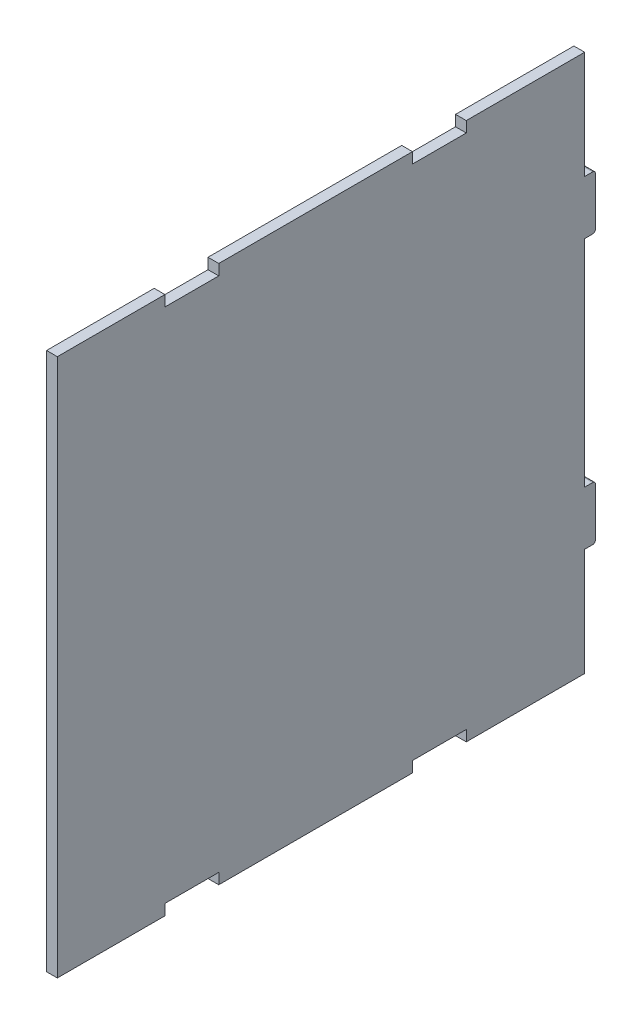
ISO-10303-21;
HEADER;
FILE_DESCRIPTION(('STEP AP214'),'2;1');
FILE_NAME('part.step','',(''),(''),'','','');
FILE_SCHEMA(('AUTOMOTIVE_DESIGN { 1 0 10303 214 1 1 1 1 }'));
ENDSEC;
DATA;
#1=APPLICATION_CONTEXT('core data for automotive mechanical design processes');
#2=APPLICATION_PROTOCOL_DEFINITION('international standard','automotive_design',2000,#1);
#3=PRODUCT_CONTEXT('',#1,'mechanical');
#4=PRODUCT('Part','Part','',(#3));
#5=PRODUCT_RELATED_PRODUCT_CATEGORY('part','',(#4));
#6=PRODUCT_DEFINITION_FORMATION('','',#4);
#7=PRODUCT_DEFINITION_CONTEXT('part definition',#1,'design');
#8=PRODUCT_DEFINITION('design','',#6,#7);
#9=PRODUCT_DEFINITION_SHAPE('','',#8);
#10=(LENGTH_UNIT() NAMED_UNIT(*) SI_UNIT(.MILLI.,.METRE.));
#11=(NAMED_UNIT(*) PLANE_ANGLE_UNIT() SI_UNIT($,.RADIAN.));
#12=(NAMED_UNIT(*) SI_UNIT($,.STERADIAN.) SOLID_ANGLE_UNIT());
#13=UNCERTAINTY_MEASURE_WITH_UNIT(LENGTH_MEASURE(1.E-05),#10,'distance_accuracy_value','');
#14=(GEOMETRIC_REPRESENTATION_CONTEXT(3) GLOBAL_UNCERTAINTY_ASSIGNED_CONTEXT((#13)) GLOBAL_UNIT_ASSIGNED_CONTEXT((#10,
#11,#12)) REPRESENTATION_CONTEXT('',''));
#15=CARTESIAN_POINT('',(0.,0.,0.));
#16=DIRECTION('',(0.,0.,1.));
#17=DIRECTION('',(1.,0.,0.));
#18=AXIS2_PLACEMENT_3D('',#15,#16,#17);
#19=CARTESIAN_POINT('',(-48.,50.,198.0199980004));
#20=DIRECTION('',(-1.,0.,0.));
#21=DIRECTION('',(0.,-1.,0.));
#22=AXIS2_PLACEMENT_3D('',#19,#20,#21);
#23=PLANE('',#22);
#24=DIRECTION('',(0.,0.,1.));
#25=VECTOR('',#24,1.);
#26=CARTESIAN_POINT('',(-48.,-30.,-12.1980390271856));
#27=LINE('',#26,#25);
#28=CARTESIAN_POINT('',(-48.,-30.,-1.5));
#29=VERTEX_POINT('',#28);
#30=CARTESIAN_POINT('',(-48.,-30.,0.));
#31=VERTEX_POINT('',#30);
#32=EDGE_CURVE('E346',#29,#31,#27,.T.);
#33=ORIENTED_EDGE('',*,*,#32,.F.);
#34=CARTESIAN_POINT('',(-48.,-29.5,-1.5));
#35=DIRECTION('',(-1.,0.,0.));
#36=DIRECTION('',(0.,-1.,0.));
#37=AXIS2_PLACEMENT_3D('',#34,#35,#36);
#38=CIRCLE('',#37,0.5);
#39=CARTESIAN_POINT('',(-48.,-29.5,-2.));
#40=VERTEX_POINT('',#39);
#41=EDGE_CURVE('E437',#29,#40,#38,.F.);
#42=ORIENTED_EDGE('',*,*,#41,.T.);
#43=DIRECTION('',(0.,-1.,0.));
#44=VECTOR('',#43,1.);
#45=CARTESIAN_POINT('',(-48.,-30.,-2.));
#46=LINE('',#45,#44);
#47=CARTESIAN_POINT('',(-48.,-20.5,-2.));
#48=VERTEX_POINT('',#47);
#49=EDGE_CURVE('E330',#48,#40,#46,.T.);
#50=ORIENTED_EDGE('',*,*,#49,.F.);
#51=CARTESIAN_POINT('',(-48.,-20.5,-1.5));
#52=DIRECTION('',(-1.,0.,0.));
#53=DIRECTION('',(0.,-1.,0.));
#54=AXIS2_PLACEMENT_3D('',#51,#52,#53);
#55=CIRCLE('',#54,0.5);
#56=CARTESIAN_POINT('',(-48.,-20.,-1.5));
#57=VERTEX_POINT('',#56);
#58=EDGE_CURVE('E435',#48,#57,#55,.F.);
#59=ORIENTED_EDGE('',*,*,#58,.T.);
#60=DIRECTION('',(0.,0.,1.));
#61=VECTOR('',#60,1.);
#62=CARTESIAN_POINT('',(-48.,-20.,-12.1980390271856));
#63=LINE('',#62,#61);
#64=CARTESIAN_POINT('',(-48.,-20.,0.));
#65=VERTEX_POINT('',#64);
#66=EDGE_CURVE('E348',#57,#65,#63,.T.);
#67=ORIENTED_EDGE('',*,*,#66,.T.);
#68=DIRECTION('',(0.,1.,0.));
#69=VECTOR('',#68,1.);
#70=CARTESIAN_POINT('',(-48.,50.,0.));
#71=LINE('',#70,#69);
#72=CARTESIAN_POINT('',(-48.,20.,0.));
#73=VERTEX_POINT('',#72);
#74=EDGE_CURVE('E392',#65,#73,#71,.T.);
#75=ORIENTED_EDGE('',*,*,#74,.T.);
#76=DIRECTION('',(0.,0.,1.));
#77=VECTOR('',#76,1.);
#78=CARTESIAN_POINT('',(-48.,20.,-12.1980390271856));
#79=LINE('',#78,#77);
#80=CARTESIAN_POINT('',(-48.,20.,-1.5));
#81=VERTEX_POINT('',#80);
#82=EDGE_CURVE('E365',#81,#73,#79,.T.);
#83=ORIENTED_EDGE('',*,*,#82,.F.);
#84=CARTESIAN_POINT('',(-48.,20.5,-1.5));
#85=DIRECTION('',(-1.,0.,0.));
#86=DIRECTION('',(0.,-1.,0.));
#87=AXIS2_PLACEMENT_3D('',#84,#85,#86);
#88=CIRCLE('',#87,0.5);
#89=CARTESIAN_POINT('',(-48.,20.5,-2.));
#90=VERTEX_POINT('',#89);
#91=EDGE_CURVE('E432',#81,#90,#88,.F.);
#92=ORIENTED_EDGE('',*,*,#91,.T.);
#93=DIRECTION('',(0.,1.,0.));
#94=VECTOR('',#93,1.);
#95=CARTESIAN_POINT('',(-48.,30.,-2.));
#96=LINE('',#95,#94);
#97=CARTESIAN_POINT('',(-48.,29.5,-2.));
#98=VERTEX_POINT('',#97);
#99=EDGE_CURVE('E351',#90,#98,#96,.T.);
#100=ORIENTED_EDGE('',*,*,#99,.T.);
#101=CARTESIAN_POINT('',(-48.,29.5,-1.5));
#102=DIRECTION('',(-1.,0.,0.));
#103=DIRECTION('',(0.,-1.,0.));
#104=AXIS2_PLACEMENT_3D('',#101,#102,#103);
#105=CIRCLE('',#104,0.5);
#106=CARTESIAN_POINT('',(-48.,30.,-1.5));
#107=VERTEX_POINT('',#106);
#108=EDGE_CURVE('E48',#98,#107,#105,.F.);
#109=ORIENTED_EDGE('',*,*,#108,.T.);
#110=DIRECTION('',(0.,0.,1.));
#111=VECTOR('',#110,1.);
#112=CARTESIAN_POINT('',(-48.,30.,-12.1980390271856));
#113=LINE('',#112,#111);
#114=CARTESIAN_POINT('',(-48.,30.,0.));
#115=VERTEX_POINT('',#114);
#116=EDGE_CURVE('E367',#107,#115,#113,.T.);
#117=ORIENTED_EDGE('',*,*,#116,.T.);
#118=CARTESIAN_POINT('',(-48.,50.,0.));
#119=VERTEX_POINT('',#118);
#120=EDGE_CURVE('E387',#115,#119,#71,.T.);
#121=ORIENTED_EDGE('',*,*,#120,.T.);
#122=DIRECTION('',(0.,0.,-1.));
#123=VECTOR('',#122,1.);
#124=CARTESIAN_POINT('',(-48.,50.,198.0199980004));
#125=LINE('',#124,#123);
#126=CARTESIAN_POINT('',(-48.,50.,22.));
#127=VERTEX_POINT('',#126);
#128=EDGE_CURVE('E399',#127,#119,#125,.T.);
#129=ORIENTED_EDGE('',*,*,#128,.F.);
#130=DIRECTION('',(0.,1.,0.));
#131=VECTOR('',#130,1.);
#132=CARTESIAN_POINT('',(-48.,50.,22.));
#133=LINE('',#132,#131);
#134=CARTESIAN_POINT('',(-48.,48.,22.0000000000001));
#135=VERTEX_POINT('',#134);
#136=EDGE_CURVE('E263',#135,#127,#133,.T.);
#137=ORIENTED_EDGE('',*,*,#136,.F.);
#138=DIRECTION('',(0.,0.,-1.));
#139=VECTOR('',#138,1.);
#140=CARTESIAN_POINT('',(-48.,48.,198.0199980004));
#141=LINE('',#140,#139);
#142=CARTESIAN_POINT('',(-48.,48.,32.));
#143=VERTEX_POINT('',#142);
#144=EDGE_CURVE('E247',#143,#135,#141,.T.);
#145=ORIENTED_EDGE('',*,*,#144,.F.);
#146=DIRECTION('',(0.,-1.,0.));
#147=VECTOR('',#146,1.);
#148=CARTESIAN_POINT('',(-48.,50.,32.));
#149=LINE('',#148,#147);
#150=CARTESIAN_POINT('',(-48.,50.,32.));
#151=VERTEX_POINT('',#150);
#152=EDGE_CURVE('E257',#151,#143,#149,.T.);
#153=ORIENTED_EDGE('',*,*,#152,.F.);
#154=CARTESIAN_POINT('',(-48.,50.,68.0000000000001));
#155=VERTEX_POINT('',#154);
#156=EDGE_CURVE('E405',#155,#151,#125,.T.);
#157=ORIENTED_EDGE('',*,*,#156,.F.);
#158=DIRECTION('',(0.,-1.,0.));
#159=VECTOR('',#158,1.);
#160=CARTESIAN_POINT('',(-48.,50.,68.));
#161=LINE('',#160,#159);
#162=CARTESIAN_POINT('',(-48.,48.,68.));
#163=VERTEX_POINT('',#162);
#164=EDGE_CURVE('E563',#155,#163,#161,.T.);
#165=ORIENTED_EDGE('',*,*,#164,.T.);
#166=CARTESIAN_POINT('',(-48.,48.,78.));
#167=VERTEX_POINT('',#166);
#168=EDGE_CURVE('E268',#167,#163,#141,.T.);
#169=ORIENTED_EDGE('',*,*,#168,.F.);
#170=DIRECTION('',(0.,1.,0.));
#171=VECTOR('',#170,1.);
#172=CARTESIAN_POINT('',(-48.,50.,78.));
#173=LINE('',#172,#171);
#174=CARTESIAN_POINT('',(-48.,50.,78.));
#175=VERTEX_POINT('',#174);
#176=EDGE_CURVE('E568',#167,#175,#173,.T.);
#177=ORIENTED_EDGE('',*,*,#176,.T.);
#178=CARTESIAN_POINT('',(-48.,50.,98.));
#179=VERTEX_POINT('',#178);
#180=EDGE_CURVE('E401',#179,#175,#125,.T.);
#181=ORIENTED_EDGE('',*,*,#180,.F.);
#182=DIRECTION('',(0.,-1.,0.));
#183=VECTOR('',#182,1.);
#184=CARTESIAN_POINT('',(-48.,50.,98.));
#185=LINE('',#184,#183);
#186=CARTESIAN_POINT('',(-48.,-50.,98.));
#187=VERTEX_POINT('',#186);
#188=EDGE_CURVE('E370',#179,#187,#185,.T.);
#189=ORIENTED_EDGE('',*,*,#188,.T.);
#190=DIRECTION('',(0.,0.,-1.));
#191=VECTOR('',#190,1.);
#192=CARTESIAN_POINT('',(-48.,-50.,198.0199980004));
#193=LINE('',#192,#191);
#194=CARTESIAN_POINT('',(-48.,-50.,78.));
#195=VERTEX_POINT('',#194);
#196=EDGE_CURVE('E406',#187,#195,#193,.T.);
#197=ORIENTED_EDGE('',*,*,#196,.T.);
#198=DIRECTION('',(0.,1.,0.));
#199=VECTOR('',#198,1.);
#200=CARTESIAN_POINT('',(-48.,-48.,78.));
#201=LINE('',#200,#199);
#202=CARTESIAN_POINT('',(-48.,-48.,78.));
#203=VERTEX_POINT('',#202);
#204=EDGE_CURVE('E310',#195,#203,#201,.T.);
#205=ORIENTED_EDGE('',*,*,#204,.T.);
#206=DIRECTION('',(0.,0.,1.));
#207=VECTOR('',#206,1.);
#208=CARTESIAN_POINT('',(-48.,-48.,198.0199980004));
#209=LINE('',#208,#207);
#210=CARTESIAN_POINT('',(-48.,-48.,68.0000000000001));
#211=VERTEX_POINT('',#210);
#212=EDGE_CURVE('E327',#211,#203,#209,.T.);
#213=ORIENTED_EDGE('',*,*,#212,.F.);
#214=DIRECTION('',(0.,-1.,0.));
#215=VECTOR('',#214,1.);
#216=CARTESIAN_POINT('',(-48.,-48.,68.));
#217=LINE('',#216,#215);
#218=CARTESIAN_POINT('',(-48.,-50.,68.));
#219=VERTEX_POINT('',#218);
#220=EDGE_CURVE('E313',#211,#219,#217,.T.);
#221=ORIENTED_EDGE('',*,*,#220,.T.);
#222=CARTESIAN_POINT('',(-48.,-50.,32.));
#223=VERTEX_POINT('',#222);
#224=EDGE_CURVE('E410',#219,#223,#193,.T.);
#225=ORIENTED_EDGE('',*,*,#224,.T.);
#226=DIRECTION('',(0.,-1.,0.));
#227=VECTOR('',#226,1.);
#228=CARTESIAN_POINT('',(-48.,-48.,32.));
#229=LINE('',#228,#227);
#230=CARTESIAN_POINT('',(-48.,-48.,32.));
#231=VERTEX_POINT('',#230);
#232=EDGE_CURVE('E279',#231,#223,#229,.T.);
#233=ORIENTED_EDGE('',*,*,#232,.F.);
#234=CARTESIAN_POINT('',(-48.,-48.,22.));
#235=VERTEX_POINT('',#234);
#236=EDGE_CURVE('E329',#235,#231,#209,.T.);
#237=ORIENTED_EDGE('',*,*,#236,.F.);
#238=DIRECTION('',(0.,1.,0.));
#239=VECTOR('',#238,1.);
#240=CARTESIAN_POINT('',(-48.,-48.,22.));
#241=LINE('',#240,#239);
#242=CARTESIAN_POINT('',(-48.,-50.,22.0000000000001));
#243=VERTEX_POINT('',#242);
#244=EDGE_CURVE('E282',#243,#235,#241,.T.);
#245=ORIENTED_EDGE('',*,*,#244,.F.);
#246=CARTESIAN_POINT('',(-48.,-50.,0.));
#247=VERTEX_POINT('',#246);
#248=EDGE_CURVE('E404',#243,#247,#193,.T.);
#249=ORIENTED_EDGE('',*,*,#248,.T.);
#250=EDGE_CURVE('E388',#247,#31,#71,.T.);
#251=ORIENTED_EDGE('',*,*,#250,.T.);
#252=EDGE_LOOP('',(#33,#42,#50,#59,#67,#75,#83,#92,#100,#109,#117,#121,#129,#137,#145,#153,#157,
#165,#169,#177,#181,#189,#197,#205,#213,#221,#225,#233,#237,#245,#249,#251));
#253=FACE_BOUND('',#252,.T.);
#254=ADVANCED_FACE('F33',(#253),#23,.F.);
#255=CARTESIAN_POINT('',(-50.,50.,198.0199980004));
#256=DIRECTION('',(1.,0.,0.));
#257=DIRECTION('',(0.,0.,-1.));
#258=AXIS2_PLACEMENT_3D('',#255,#256,#257);
#259=PLANE('',#258);
#260=DIRECTION('',(0.,1.,0.));
#261=VECTOR('',#260,1.);
#262=CARTESIAN_POINT('',(-50.,-30.,-2.));
#263=LINE('',#262,#261);
#264=CARTESIAN_POINT('',(-50.,-29.5,-2.));
#265=VERTEX_POINT('',#264);
#266=CARTESIAN_POINT('',(-50.,-20.5,-2.));
#267=VERTEX_POINT('',#266);
#268=EDGE_CURVE('E333',#265,#267,#263,.T.);
#269=ORIENTED_EDGE('',*,*,#268,.F.);
#270=CARTESIAN_POINT('',(-50.,-29.5,-1.5));
#271=DIRECTION('',(1.,0.,0.));
#272=DIRECTION('',(0.,0.,-1.));
#273=AXIS2_PLACEMENT_3D('',#270,#271,#272);
#274=CIRCLE('',#273,0.5);
#275=CARTESIAN_POINT('',(-50.,-30.,-1.5));
#276=VERTEX_POINT('',#275);
#277=EDGE_CURVE('E428',#265,#276,#274,.F.);
#278=ORIENTED_EDGE('',*,*,#277,.T.);
#279=DIRECTION('',(0.,0.,1.));
#280=VECTOR('',#279,1.);
#281=CARTESIAN_POINT('',(-50.,-30.,-12.1980390271856));
#282=LINE('',#281,#280);
#283=CARTESIAN_POINT('',(-50.,-30.,0.));
#284=VERTEX_POINT('',#283);
#285=EDGE_CURVE('E344',#276,#284,#282,.T.);
#286=ORIENTED_EDGE('',*,*,#285,.T.);
#287=DIRECTION('',(0.,-1.,0.));
#288=VECTOR('',#287,1.);
#289=CARTESIAN_POINT('',(-50.,50.,0.));
#290=LINE('',#289,#288);
#291=CARTESIAN_POINT('',(-50.,-50.,0.));
#292=VERTEX_POINT('',#291);
#293=EDGE_CURVE('E357',#284,#292,#290,.T.);
#294=ORIENTED_EDGE('',*,*,#293,.T.);
#295=DIRECTION('',(0.,0.,-1.));
#296=VECTOR('',#295,1.);
#297=CARTESIAN_POINT('',(-50.,-50.,198.0199980004));
#298=LINE('',#297,#296);
#299=CARTESIAN_POINT('',(-50.,-50.,22.));
#300=VERTEX_POINT('',#299);
#301=EDGE_CURVE('E409',#300,#292,#298,.T.);
#302=ORIENTED_EDGE('',*,*,#301,.F.);
#303=DIRECTION('',(0.,-1.,0.));
#304=VECTOR('',#303,1.);
#305=CARTESIAN_POINT('',(-50.,-48.,22.));
#306=LINE('',#305,#304);
#307=CARTESIAN_POINT('',(-50.,-48.,22.));
#308=VERTEX_POINT('',#307);
#309=EDGE_CURVE('E290',#308,#300,#306,.T.);
#310=ORIENTED_EDGE('',*,*,#309,.F.);
#311=DIRECTION('',(0.,0.,-1.));
#312=VECTOR('',#311,1.);
#313=CARTESIAN_POINT('',(-50.,-48.,22.));
#314=LINE('',#313,#312);
#315=CARTESIAN_POINT('',(-50.,-48.,32.));
#316=VERTEX_POINT('',#315);
#317=EDGE_CURVE('E281',#316,#308,#314,.T.);
#318=ORIENTED_EDGE('',*,*,#317,.F.);
#319=DIRECTION('',(0.,1.,0.));
#320=VECTOR('',#319,1.);
#321=CARTESIAN_POINT('',(-50.,-48.,32.));
#322=LINE('',#321,#320);
#323=CARTESIAN_POINT('',(-50.,-50.,32.0000000000001));
#324=VERTEX_POINT('',#323);
#325=EDGE_CURVE('E286',#324,#316,#322,.T.);
#326=ORIENTED_EDGE('',*,*,#325,.F.);
#327=CARTESIAN_POINT('',(-50.,-50.,68.));
#328=VERTEX_POINT('',#327);
#329=EDGE_CURVE('E414',#328,#324,#298,.T.);
#330=ORIENTED_EDGE('',*,*,#329,.F.);
#331=DIRECTION('',(0.,1.,0.));
#332=VECTOR('',#331,1.);
#333=CARTESIAN_POINT('',(-50.,-48.,68.));
#334=LINE('',#333,#332);
#335=CARTESIAN_POINT('',(-50.,-48.,68.));
#336=VERTEX_POINT('',#335);
#337=EDGE_CURVE('E289',#328,#336,#334,.T.);
#338=ORIENTED_EDGE('',*,*,#337,.T.);
#339=DIRECTION('',(0.,0.,1.));
#340=VECTOR('',#339,1.);
#341=CARTESIAN_POINT('',(-50.,-48.,78.));
#342=LINE('',#341,#340);
#343=CARTESIAN_POINT('',(-50.,-48.,78.));
#344=VERTEX_POINT('',#343);
#345=EDGE_CURVE('E304',#336,#344,#342,.T.);
#346=ORIENTED_EDGE('',*,*,#345,.T.);
#347=DIRECTION('',(0.,-1.,0.));
#348=VECTOR('',#347,1.);
#349=CARTESIAN_POINT('',(-50.,-48.,78.));
#350=LINE('',#349,#348);
#351=CARTESIAN_POINT('',(-50.,-50.,78.));
#352=VERTEX_POINT('',#351);
#353=EDGE_CURVE('E307',#344,#352,#350,.T.);
#354=ORIENTED_EDGE('',*,*,#353,.T.);
#355=CARTESIAN_POINT('',(-50.,-50.,98.));
#356=VERTEX_POINT('',#355);
#357=EDGE_CURVE('E411',#356,#352,#298,.T.);
#358=ORIENTED_EDGE('',*,*,#357,.F.);
#359=DIRECTION('',(0.,1.,0.));
#360=VECTOR('',#359,1.);
#361=CARTESIAN_POINT('',(-50.,50.,98.));
#362=LINE('',#361,#360);
#363=CARTESIAN_POINT('',(-50.,50.,98.));
#364=VERTEX_POINT('',#363);
#365=EDGE_CURVE('E376',#356,#364,#362,.T.);
#366=ORIENTED_EDGE('',*,*,#365,.T.);
#367=DIRECTION('',(0.,0.,-1.));
#368=VECTOR('',#367,1.);
#369=CARTESIAN_POINT('',(-50.,50.,198.0199980004));
#370=LINE('',#369,#368);
#371=CARTESIAN_POINT('',(-50.,50.,78.));
#372=VERTEX_POINT('',#371);
#373=EDGE_CURVE('E396',#364,#372,#370,.T.);
#374=ORIENTED_EDGE('',*,*,#373,.T.);
#375=DIRECTION('',(0.,-1.,0.));
#376=VECTOR('',#375,1.);
#377=CARTESIAN_POINT('',(-50.,50.,78.));
#378=LINE('',#377,#376);
#379=CARTESIAN_POINT('',(-50.,48.,78.));
#380=VERTEX_POINT('',#379);
#381=EDGE_CURVE('E269',#372,#380,#378,.T.);
#382=ORIENTED_EDGE('',*,*,#381,.T.);
#383=DIRECTION('',(0.,0.,-1.));
#384=VECTOR('',#383,1.);
#385=CARTESIAN_POINT('',(-50.,48.,78.));
#386=LINE('',#385,#384);
#387=CARTESIAN_POINT('',(-50.,48.,68.));
#388=VERTEX_POINT('',#387);
#389=EDGE_CURVE('E277',#380,#388,#386,.T.);
#390=ORIENTED_EDGE('',*,*,#389,.T.);
#391=DIRECTION('',(0.,1.,0.));
#392=VECTOR('',#391,1.);
#393=CARTESIAN_POINT('',(-50.,50.,68.));
#394=LINE('',#393,#392);
#395=CARTESIAN_POINT('',(-50.,50.,68.));
#396=VERTEX_POINT('',#395);
#397=EDGE_CURVE('E273',#388,#396,#394,.T.);
#398=ORIENTED_EDGE('',*,*,#397,.T.);
#399=CARTESIAN_POINT('',(-50.,50.,32.));
#400=VERTEX_POINT('',#399);
#401=EDGE_CURVE('E400',#396,#400,#370,.T.);
#402=ORIENTED_EDGE('',*,*,#401,.T.);
#403=DIRECTION('',(0.,1.,0.));
#404=VECTOR('',#403,1.);
#405=CARTESIAN_POINT('',(-50.,50.,32.));
#406=LINE('',#405,#404);
#407=CARTESIAN_POINT('',(-50.,48.,32.));
#408=VERTEX_POINT('',#407);
#409=EDGE_CURVE('E584',#408,#400,#406,.T.);
#410=ORIENTED_EDGE('',*,*,#409,.F.);
#411=DIRECTION('',(0.,0.,1.));
#412=VECTOR('',#411,1.);
#413=CARTESIAN_POINT('',(-50.,48.,22.));
#414=LINE('',#413,#412);
#415=CARTESIAN_POINT('',(-50.,48.,22.));
#416=VERTEX_POINT('',#415);
#417=EDGE_CURVE('E250',#416,#408,#414,.T.);
#418=ORIENTED_EDGE('',*,*,#417,.F.);
#419=DIRECTION('',(0.,-1.,0.));
#420=VECTOR('',#419,1.);
#421=CARTESIAN_POINT('',(-50.,50.,22.));
#422=LINE('',#421,#420);
#423=CARTESIAN_POINT('',(-50.,50.,22.));
#424=VERTEX_POINT('',#423);
#425=EDGE_CURVE('E573',#424,#416,#422,.T.);
#426=ORIENTED_EDGE('',*,*,#425,.F.);
#427=CARTESIAN_POINT('',(-50.,50.,0.));
#428=VERTEX_POINT('',#427);
#429=EDGE_CURVE('E395',#424,#428,#370,.T.);
#430=ORIENTED_EDGE('',*,*,#429,.T.);
#431=CARTESIAN_POINT('',(-50.,30.,0.));
#432=VERTEX_POINT('',#431);
#433=EDGE_CURVE('E380',#428,#432,#290,.T.);
#434=ORIENTED_EDGE('',*,*,#433,.T.);
#435=DIRECTION('',(0.,0.,1.));
#436=VECTOR('',#435,1.);
#437=CARTESIAN_POINT('',(-50.,30.,-12.1980390271856));
#438=LINE('',#437,#436);
#439=CARTESIAN_POINT('',(-50.,30.,-1.5));
#440=VERTEX_POINT('',#439);
#441=EDGE_CURVE('E354',#440,#432,#438,.T.);
#442=ORIENTED_EDGE('',*,*,#441,.F.);
#443=CARTESIAN_POINT('',(-50.,29.5,-1.5));
#444=DIRECTION('',(1.,0.,0.));
#445=DIRECTION('',(0.,0.,-1.));
#446=AXIS2_PLACEMENT_3D('',#443,#444,#445);
#447=CIRCLE('',#446,0.5);
#448=CARTESIAN_POINT('',(-50.,29.5,-2.));
#449=VERTEX_POINT('',#448);
#450=EDGE_CURVE('E424',#440,#449,#447,.F.);
#451=ORIENTED_EDGE('',*,*,#450,.T.);
#452=DIRECTION('',(0.,-1.,0.));
#453=VECTOR('',#452,1.);
#454=CARTESIAN_POINT('',(-50.,30.,-2.));
#455=LINE('',#454,#453);
#456=CARTESIAN_POINT('',(-50.,20.5,-2.));
#457=VERTEX_POINT('',#456);
#458=EDGE_CURVE('E353',#449,#457,#455,.T.);
#459=ORIENTED_EDGE('',*,*,#458,.T.);
#460=CARTESIAN_POINT('',(-50.,20.5,-1.5));
#461=DIRECTION('',(1.,0.,0.));
#462=DIRECTION('',(0.,0.,-1.));
#463=AXIS2_PLACEMENT_3D('',#460,#461,#462);
#464=CIRCLE('',#463,0.5);
#465=CARTESIAN_POINT('',(-50.,20.,-1.5));
#466=VERTEX_POINT('',#465);
#467=EDGE_CURVE('E422',#457,#466,#464,.F.);
#468=ORIENTED_EDGE('',*,*,#467,.T.);
#469=DIRECTION('',(0.,0.,1.));
#470=VECTOR('',#469,1.);
#471=CARTESIAN_POINT('',(-50.,20.,-12.1980390271856));
#472=LINE('',#471,#470);
#473=CARTESIAN_POINT('',(-50.,20.,0.));
#474=VERTEX_POINT('',#473);
#475=EDGE_CURVE('E363',#466,#474,#472,.T.);
#476=ORIENTED_EDGE('',*,*,#475,.T.);
#477=CARTESIAN_POINT('',(-50.,-20.,0.));
#478=VERTEX_POINT('',#477);
#479=EDGE_CURVE('E384',#474,#478,#290,.T.);
#480=ORIENTED_EDGE('',*,*,#479,.T.);
#481=DIRECTION('',(0.,0.,1.));
#482=VECTOR('',#481,1.);
#483=CARTESIAN_POINT('',(-50.,-20.,-12.1980390271856));
#484=LINE('',#483,#482);
#485=CARTESIAN_POINT('',(-50.,-20.,-1.5));
#486=VERTEX_POINT('',#485);
#487=EDGE_CURVE('E334',#486,#478,#484,.T.);
#488=ORIENTED_EDGE('',*,*,#487,.F.);
#489=CARTESIAN_POINT('',(-50.,-20.5,-1.5));
#490=DIRECTION('',(1.,0.,0.));
#491=DIRECTION('',(0.,0.,-1.));
#492=AXIS2_PLACEMENT_3D('',#489,#490,#491);
#493=CIRCLE('',#492,0.5);
#494=EDGE_CURVE('E426',#486,#267,#493,.F.);
#495=ORIENTED_EDGE('',*,*,#494,.T.);
#496=EDGE_LOOP('',(#269,#278,#286,#294,#302,#310,#318,#326,#330,#338,#346,#354,#358,#366,#374,
#382,#390,#398,#402,#410,#418,#426,#430,#434,#442,#451,#459,#468,#476,#480,#488,#495));
#497=FACE_BOUND('',#496,.T.);
#498=ADVANCED_FACE('F451',(#497),#259,.F.);
#499=CARTESIAN_POINT('',(-50.,50.,198.0199980004));
#500=DIRECTION('',(0.,-1.,0.));
#501=DIRECTION('',(0.,0.,-1.));
#502=AXIS2_PLACEMENT_3D('',#499,#500,#501);
#503=PLANE('',#502);
#504=DIRECTION('',(1.,0.,0.));
#505=VECTOR('',#504,1.);
#506=CARTESIAN_POINT('',(-60.1980390271856,50.,68.));
#507=LINE('',#506,#505);
#508=EDGE_CURVE('E560',#396,#155,#507,.T.);
#509=ORIENTED_EDGE('',*,*,#508,.T.);
#510=ORIENTED_EDGE('',*,*,#156,.T.);
#511=DIRECTION('',(1.,0.,0.));
#512=VECTOR('',#511,1.);
#513=CARTESIAN_POINT('',(-60.1980390271856,50.,32.));
#514=LINE('',#513,#512);
#515=EDGE_CURVE('E254',#400,#151,#514,.T.);
#516=ORIENTED_EDGE('',*,*,#515,.F.);
#517=ORIENTED_EDGE('',*,*,#401,.F.);
#518=EDGE_LOOP('',(#509,#510,#516,#517));
#519=FACE_BOUND('',#518,.T.);
#520=ADVANCED_FACE('F519',(#519),#503,.F.);
#521=DIRECTION('',(1.,0.,0.));
#522=VECTOR('',#521,1.);
#523=CARTESIAN_POINT('',(-60.1980390271856,50.,78.));
#524=LINE('',#523,#522);
#525=EDGE_CURVE('E577',#372,#175,#524,.T.);
#526=ORIENTED_EDGE('',*,*,#525,.F.);
#527=ORIENTED_EDGE('',*,*,#373,.F.);
#528=DIRECTION('',(1.,0.,0.));
#529=VECTOR('',#528,1.);
#530=CARTESIAN_POINT('',(-50.,50.,98.));
#531=LINE('',#530,#529);
#532=EDGE_CURVE('E373',#364,#179,#531,.T.);
#533=ORIENTED_EDGE('',*,*,#532,.T.);
#534=ORIENTED_EDGE('',*,*,#180,.T.);
#535=EDGE_LOOP('',(#526,#527,#533,#534));
#536=FACE_BOUND('',#535,.T.);
#537=ADVANCED_FACE('F628',(#536),#503,.F.);
#538=ORIENTED_EDGE('',*,*,#429,.F.);
#539=DIRECTION('',(1.,0.,0.));
#540=VECTOR('',#539,1.);
#541=CARTESIAN_POINT('',(-60.1980390271856,50.,22.));
#542=LINE('',#541,#540);
#543=EDGE_CURVE('E262',#424,#127,#542,.T.);
#544=ORIENTED_EDGE('',*,*,#543,.T.);
#545=ORIENTED_EDGE('',*,*,#128,.T.);
#546=DIRECTION('',(-1.,0.,0.));
#547=VECTOR('',#546,1.);
#548=CARTESIAN_POINT('',(-50.,50.,0.));
#549=LINE('',#548,#547);
#550=EDGE_CURVE('E391',#119,#428,#549,.T.);
#551=ORIENTED_EDGE('',*,*,#550,.T.);
#552=EDGE_LOOP('',(#538,#544,#545,#551));
#553=FACE_BOUND('',#552,.T.);
#554=ADVANCED_FACE('F526',(#553),#503,.F.);
#555=CARTESIAN_POINT('',(-50.,-50.,198.0199980004));
#556=DIRECTION('',(0.,1.,0.));
#557=DIRECTION('',(0.,0.,1.));
#558=AXIS2_PLACEMENT_3D('',#555,#556,#557);
#559=PLANE('',#558);
#560=DIRECTION('',(1.,0.,0.));
#561=VECTOR('',#560,1.);
#562=CARTESIAN_POINT('',(-60.1980390271856,-50.,68.));
#563=LINE('',#562,#561);
#564=EDGE_CURVE('E319',#328,#219,#563,.T.);
#565=ORIENTED_EDGE('',*,*,#564,.F.);
#566=ORIENTED_EDGE('',*,*,#329,.T.);
#567=DIRECTION('',(1.,0.,0.));
#568=VECTOR('',#567,1.);
#569=CARTESIAN_POINT('',(-60.1980390271856,-50.,32.));
#570=LINE('',#569,#568);
#571=EDGE_CURVE('E296',#324,#223,#570,.T.);
#572=ORIENTED_EDGE('',*,*,#571,.T.);
#573=ORIENTED_EDGE('',*,*,#224,.F.);
#574=EDGE_LOOP('',(#565,#566,#572,#573));
#575=FACE_BOUND('',#574,.T.);
#576=ADVANCED_FACE('F486',(#575),#559,.F.);
#577=DIRECTION('',(1.,0.,0.));
#578=VECTOR('',#577,1.);
#579=CARTESIAN_POINT('',(-60.1980390271856,-50.,78.));
#580=LINE('',#579,#578);
#581=EDGE_CURVE('E316',#352,#195,#580,.T.);
#582=ORIENTED_EDGE('',*,*,#581,.T.);
#583=ORIENTED_EDGE('',*,*,#196,.F.);
#584=DIRECTION('',(-1.,0.,0.));
#585=VECTOR('',#584,1.);
#586=CARTESIAN_POINT('',(-50.,-50.,98.));
#587=LINE('',#586,#585);
#588=EDGE_CURVE('E372',#187,#356,#587,.T.);
#589=ORIENTED_EDGE('',*,*,#588,.T.);
#590=ORIENTED_EDGE('',*,*,#357,.T.);
#591=EDGE_LOOP('',(#582,#583,#589,#590));
#592=FACE_BOUND('',#591,.T.);
#593=ADVANCED_FACE('F525',(#592),#559,.F.);
#594=ORIENTED_EDGE('',*,*,#248,.F.);
#595=DIRECTION('',(1.,0.,0.));
#596=VECTOR('',#595,1.);
#597=CARTESIAN_POINT('',(-60.1980390271856,-50.,22.));
#598=LINE('',#597,#596);
#599=EDGE_CURVE('E294',#300,#243,#598,.T.);
#600=ORIENTED_EDGE('',*,*,#599,.F.);
#601=ORIENTED_EDGE('',*,*,#301,.T.);
#602=DIRECTION('',(1.,0.,0.));
#603=VECTOR('',#602,1.);
#604=CARTESIAN_POINT('',(-50.,-50.,0.));
#605=LINE('',#604,#603);
#606=EDGE_CURVE('E383',#292,#247,#605,.T.);
#607=ORIENTED_EDGE('',*,*,#606,.T.);
#608=EDGE_LOOP('',(#594,#600,#601,#607));
#609=FACE_BOUND('',#608,.T.);
#610=ADVANCED_FACE('F480',(#609),#559,.F.);
#611=CARTESIAN_POINT('',(0.,0.,0.));
#612=DIRECTION('',(0.,0.,1.));
#613=DIRECTION('',(1.,0.,0.));
#614=AXIS2_PLACEMENT_3D('',#611,#612,#613);
#615=PLANE('',#614);
#616=ORIENTED_EDGE('',*,*,#74,.F.);
#617=DIRECTION('',(-1.,0.,0.));
#618=VECTOR('',#617,1.);
#619=CARTESIAN_POINT('',(-50.,-20.,0.));
#620=LINE('',#619,#618);
#621=EDGE_CURVE('E338',#65,#478,#620,.T.);
#622=ORIENTED_EDGE('',*,*,#621,.T.);
#623=ORIENTED_EDGE('',*,*,#479,.F.);
#624=DIRECTION('',(-1.,0.,0.));
#625=VECTOR('',#624,1.);
#626=CARTESIAN_POINT('',(-50.,20.,0.));
#627=LINE('',#626,#625);
#628=EDGE_CURVE('E360',#73,#474,#627,.T.);
#629=ORIENTED_EDGE('',*,*,#628,.F.);
#630=EDGE_LOOP('',(#616,#622,#623,#629));
#631=FACE_BOUND('',#630,.T.);
#632=ADVANCED_FACE('F465',(#631),#615,.F.);
#633=ORIENTED_EDGE('',*,*,#293,.F.);
#634=DIRECTION('',(1.,0.,0.));
#635=VECTOR('',#634,1.);
#636=CARTESIAN_POINT('',(-50.,-30.,0.));
#637=LINE('',#636,#635);
#638=EDGE_CURVE('E341',#284,#31,#637,.T.);
#639=ORIENTED_EDGE('',*,*,#638,.T.);
#640=ORIENTED_EDGE('',*,*,#250,.F.);
#641=ORIENTED_EDGE('',*,*,#606,.F.);
#642=EDGE_LOOP('',(#633,#639,#640,#641));
#643=FACE_BOUND('',#642,.T.);
#644=ADVANCED_FACE('F477',(#643),#615,.F.);
#645=DIRECTION('',(1.,0.,0.));
#646=VECTOR('',#645,1.);
#647=CARTESIAN_POINT('',(-50.,30.,0.));
#648=LINE('',#647,#646);
#649=EDGE_CURVE('E337',#432,#115,#648,.T.);
#650=ORIENTED_EDGE('',*,*,#649,.F.);
#651=ORIENTED_EDGE('',*,*,#433,.F.);
#652=ORIENTED_EDGE('',*,*,#550,.F.);
#653=ORIENTED_EDGE('',*,*,#120,.F.);
#654=EDGE_LOOP('',(#650,#651,#652,#653));
#655=FACE_BOUND('',#654,.T.);
#656=ADVANCED_FACE('F551',(#655),#615,.F.);
#657=CARTESIAN_POINT('',(0.,0.,98.));
#658=DIRECTION('',(0.,0.,-1.));
#659=DIRECTION('',(-1.,0.,0.));
#660=AXIS2_PLACEMENT_3D('',#657,#658,#659);
#661=PLANE('',#660);
#662=ORIENTED_EDGE('',*,*,#588,.F.);
#663=ORIENTED_EDGE('',*,*,#188,.F.);
#664=ORIENTED_EDGE('',*,*,#532,.F.);
#665=ORIENTED_EDGE('',*,*,#365,.F.);
#666=EDGE_LOOP('',(#662,#663,#664,#665));
#667=FACE_BOUND('',#666,.T.);
#668=ADVANCED_FACE('F632',(#667),#661,.F.);
#669=CARTESIAN_POINT('',(-50.,20.,-12.1980390271856));
#670=DIRECTION('',(0.,1.,0.));
#671=DIRECTION('',(0.,0.,1.));
#672=AXIS2_PLACEMENT_3D('',#669,#670,#671);
#673=PLANE('',#672);
#674=ORIENTED_EDGE('',*,*,#475,.F.);
#675=DIRECTION('',(1.,0.,0.));
#676=VECTOR('',#675,1.);
#677=CARTESIAN_POINT('',(-50.,20.,-1.5));
#678=LINE('',#677,#676);
#679=EDGE_CURVE('E11',#466,#81,#678,.T.);
#680=ORIENTED_EDGE('',*,*,#679,.T.);
#681=ORIENTED_EDGE('',*,*,#82,.T.);
#682=ORIENTED_EDGE('',*,*,#628,.T.);
#683=EDGE_LOOP('',(#674,#680,#681,#682));
#684=FACE_BOUND('',#683,.T.);
#685=ADVANCED_FACE('F457',(#684),#673,.F.);
#686=CARTESIAN_POINT('',(-50.,30.,-12.1980390271856));
#687=DIRECTION('',(0.,-1.,0.));
#688=DIRECTION('',(0.,0.,-1.));
#689=AXIS2_PLACEMENT_3D('',#686,#687,#688);
#690=PLANE('',#689);
#691=ORIENTED_EDGE('',*,*,#116,.F.);
#692=DIRECTION('',(-1.,0.,0.));
#693=VECTOR('',#692,1.);
#694=CARTESIAN_POINT('',(-50.,30.,-1.5));
#695=LINE('',#694,#693);
#696=EDGE_CURVE('E441',#107,#440,#695,.T.);
#697=ORIENTED_EDGE('',*,*,#696,.T.);
#698=ORIENTED_EDGE('',*,*,#441,.T.);
#699=ORIENTED_EDGE('',*,*,#649,.T.);
#700=EDGE_LOOP('',(#691,#697,#698,#699));
#701=FACE_BOUND('',#700,.T.);
#702=ADVANCED_FACE('F544',(#701),#690,.F.);
#703=CARTESIAN_POINT('',(0.,0.,-2.));
#704=DIRECTION('',(0.,0.,1.));
#705=DIRECTION('',(0.,-1.,0.));
#706=AXIS2_PLACEMENT_3D('',#703,#704,#705);
#707=PLANE('',#706);
#708=ORIENTED_EDGE('',*,*,#458,.F.);
#709=DIRECTION('',(-1.,0.,0.));
#710=VECTOR('',#709,1.);
#711=CARTESIAN_POINT('',(0.,29.5,-2.));
#712=LINE('',#711,#710);
#713=EDGE_CURVE('E41',#449,#98,#712,.F.);
#714=ORIENTED_EDGE('',*,*,#713,.T.);
#715=ORIENTED_EDGE('',*,*,#99,.F.);
#716=DIRECTION('',(1.,0.,0.));
#717=VECTOR('',#716,1.);
#718=CARTESIAN_POINT('',(0.,20.5,-2.));
#719=LINE('',#718,#717);
#720=EDGE_CURVE('E444',#90,#457,#719,.F.);
#721=ORIENTED_EDGE('',*,*,#720,.T.);
#722=EDGE_LOOP('',(#708,#714,#715,#721));
#723=FACE_BOUND('',#722,.T.);
#724=ADVANCED_FACE('F446',(#723),#707,.F.);
#725=CARTESIAN_POINT('',(-50.,-20.,-12.1980390271856));
#726=DIRECTION('',(0.,1.,0.));
#727=DIRECTION('',(0.,0.,1.));
#728=AXIS2_PLACEMENT_3D('',#725,#726,#727);
#729=PLANE('',#728);
#730=ORIENTED_EDGE('',*,*,#66,.F.);
#731=DIRECTION('',(1.,0.,0.));
#732=VECTOR('',#731,1.);
#733=CARTESIAN_POINT('',(-50.,-20.,-1.5));
#734=LINE('',#733,#732);
#735=EDGE_CURVE('E439',#57,#486,#734,.F.);
#736=ORIENTED_EDGE('',*,*,#735,.T.);
#737=ORIENTED_EDGE('',*,*,#487,.T.);
#738=ORIENTED_EDGE('',*,*,#621,.F.);
#739=EDGE_LOOP('',(#730,#736,#737,#738));
#740=FACE_BOUND('',#739,.T.);
#741=ADVANCED_FACE('F795',(#740),#729,.T.);
#742=CARTESIAN_POINT('',(-50.,-30.,-12.1980390271856));
#743=DIRECTION('',(0.,-1.,0.));
#744=DIRECTION('',(0.,0.,-1.));
#745=AXIS2_PLACEMENT_3D('',#742,#743,#744);
#746=PLANE('',#745);
#747=ORIENTED_EDGE('',*,*,#285,.F.);
#748=DIRECTION('',(-1.,0.,0.));
#749=VECTOR('',#748,1.);
#750=CARTESIAN_POINT('',(-48.,-30.,-1.5));
#751=LINE('',#750,#749);
#752=EDGE_CURVE('E430',#276,#29,#751,.F.);
#753=ORIENTED_EDGE('',*,*,#752,.T.);
#754=ORIENTED_EDGE('',*,*,#32,.T.);
#755=ORIENTED_EDGE('',*,*,#638,.F.);
#756=EDGE_LOOP('',(#747,#753,#754,#755));
#757=FACE_BOUND('',#756,.T.);
#758=ADVANCED_FACE('F788',(#757),#746,.T.);
#759=CARTESIAN_POINT('',(0.,0.,-2.));
#760=DIRECTION('',(0.,0.,1.));
#761=DIRECTION('',(0.,-1.,0.));
#762=AXIS2_PLACEMENT_3D('',#759,#760,#761);
#763=PLANE('',#762);
#764=ORIENTED_EDGE('',*,*,#49,.T.);
#765=DIRECTION('',(-1.,0.,0.));
#766=VECTOR('',#765,1.);
#767=CARTESIAN_POINT('',(-50.,-29.5,-2.));
#768=LINE('',#767,#766);
#769=EDGE_CURVE('E419',#40,#265,#768,.T.);
#770=ORIENTED_EDGE('',*,*,#769,.T.);
#771=ORIENTED_EDGE('',*,*,#268,.T.);
#772=DIRECTION('',(1.,0.,0.));
#773=VECTOR('',#772,1.);
#774=CARTESIAN_POINT('',(-48.,-20.5,-2.));
#775=LINE('',#774,#773);
#776=EDGE_CURVE('E379',#267,#48,#775,.T.);
#777=ORIENTED_EDGE('',*,*,#776,.T.);
#778=EDGE_LOOP('',(#764,#770,#771,#777));
#779=FACE_BOUND('',#778,.T.);
#780=ADVANCED_FACE('F613',(#779),#763,.F.);
#781=CARTESIAN_POINT('',(-60.1980390271856,-48.,32.));
#782=DIRECTION('',(0.,0.,1.));
#783=DIRECTION('',(1.,0.,0.));
#784=AXIS2_PLACEMENT_3D('',#781,#782,#783);
#785=PLANE('',#784);
#786=ORIENTED_EDGE('',*,*,#325,.T.);
#787=DIRECTION('',(1.,0.,0.));
#788=VECTOR('',#787,1.);
#789=CARTESIAN_POINT('',(-60.1980390271856,-48.,32.));
#790=LINE('',#789,#788);
#791=EDGE_CURVE('E285',#316,#231,#790,.T.);
#792=ORIENTED_EDGE('',*,*,#791,.T.);
#793=ORIENTED_EDGE('',*,*,#232,.T.);
#794=ORIENTED_EDGE('',*,*,#571,.F.);
#795=EDGE_LOOP('',(#786,#792,#793,#794));
#796=FACE_BOUND('',#795,.T.);
#797=ADVANCED_FACE('F492',(#796),#785,.F.);
#798=CARTESIAN_POINT('',(-60.1980390271856,-48.,22.));
#799=DIRECTION('',(0.,0.,-1.));
#800=DIRECTION('',(-1.,0.,0.));
#801=AXIS2_PLACEMENT_3D('',#798,#799,#800);
#802=PLANE('',#801);
#803=ORIENTED_EDGE('',*,*,#309,.T.);
#804=ORIENTED_EDGE('',*,*,#599,.T.);
#805=ORIENTED_EDGE('',*,*,#244,.T.);
#806=DIRECTION('',(1.,0.,0.));
#807=VECTOR('',#806,1.);
#808=CARTESIAN_POINT('',(-60.1980390271856,-48.,22.));
#809=LINE('',#808,#807);
#810=EDGE_CURVE('E271',#308,#235,#809,.T.);
#811=ORIENTED_EDGE('',*,*,#810,.F.);
#812=EDGE_LOOP('',(#803,#804,#805,#811));
#813=FACE_BOUND('',#812,.T.);
#814=ADVANCED_FACE('F498',(#813),#802,.F.);
#815=CARTESIAN_POINT('',(-48.,-48.,194.020831073262));
#816=DIRECTION('',(0.,-1.,0.));
#817=DIRECTION('',(0.,0.,-1.));
#818=AXIS2_PLACEMENT_3D('',#815,#816,#817);
#819=PLANE('',#818);
#820=ORIENTED_EDGE('',*,*,#236,.T.);
#821=ORIENTED_EDGE('',*,*,#791,.F.);
#822=ORIENTED_EDGE('',*,*,#317,.T.);
#823=ORIENTED_EDGE('',*,*,#810,.T.);
#824=EDGE_LOOP('',(#820,#821,#822,#823));
#825=FACE_BOUND('',#824,.T.);
#826=ADVANCED_FACE('F500',(#825),#819,.T.);
#827=ORIENTED_EDGE('',*,*,#212,.T.);
#828=DIRECTION('',(1.,0.,0.));
#829=VECTOR('',#828,1.);
#830=CARTESIAN_POINT('',(-60.1980390271856,-48.,78.));
#831=LINE('',#830,#829);
#832=EDGE_CURVE('E324',#344,#203,#831,.T.);
#833=ORIENTED_EDGE('',*,*,#832,.F.);
#834=ORIENTED_EDGE('',*,*,#345,.F.);
#835=DIRECTION('',(1.,0.,0.));
#836=VECTOR('',#835,1.);
#837=CARTESIAN_POINT('',(-60.1980390271856,-48.,68.));
#838=LINE('',#837,#836);
#839=EDGE_CURVE('E321',#336,#211,#838,.T.);
#840=ORIENTED_EDGE('',*,*,#839,.T.);
#841=EDGE_LOOP('',(#827,#833,#834,#840));
#842=FACE_BOUND('',#841,.T.);
#843=ADVANCED_FACE('F502',(#842),#819,.T.);
#844=CARTESIAN_POINT('',(-60.1980390271856,-48.,68.));
#845=DIRECTION('',(0.,0.,1.));
#846=DIRECTION('',(1.,0.,0.));
#847=AXIS2_PLACEMENT_3D('',#844,#845,#846);
#848=PLANE('',#847);
#849=ORIENTED_EDGE('',*,*,#564,.T.);
#850=ORIENTED_EDGE('',*,*,#220,.F.);
#851=ORIENTED_EDGE('',*,*,#839,.F.);
#852=ORIENTED_EDGE('',*,*,#337,.F.);
#853=EDGE_LOOP('',(#849,#850,#851,#852));
#854=FACE_BOUND('',#853,.T.);
#855=ADVANCED_FACE('F508',(#854),#848,.T.);
#856=CARTESIAN_POINT('',(-60.1980390271856,-48.,78.));
#857=DIRECTION('',(0.,0.,-1.));
#858=DIRECTION('',(-1.,0.,0.));
#859=AXIS2_PLACEMENT_3D('',#856,#857,#858);
#860=PLANE('',#859);
#861=ORIENTED_EDGE('',*,*,#832,.T.);
#862=ORIENTED_EDGE('',*,*,#204,.F.);
#863=ORIENTED_EDGE('',*,*,#581,.F.);
#864=ORIENTED_EDGE('',*,*,#353,.F.);
#865=EDGE_LOOP('',(#861,#862,#863,#864));
#866=FACE_BOUND('',#865,.T.);
#867=ADVANCED_FACE('F594',(#866),#860,.T.);
#868=CARTESIAN_POINT('',(-60.1980390271856,50.,22.));
#869=DIRECTION('',(0.,0.,-1.));
#870=DIRECTION('',(-1.,0.,0.));
#871=AXIS2_PLACEMENT_3D('',#868,#869,#870);
#872=PLANE('',#871);
#873=ORIENTED_EDGE('',*,*,#425,.T.);
#874=DIRECTION('',(1.,0.,0.));
#875=VECTOR('',#874,1.);
#876=CARTESIAN_POINT('',(-60.1980390271856,48.,22.));
#877=LINE('',#876,#875);
#878=EDGE_CURVE('E253',#416,#135,#877,.T.);
#879=ORIENTED_EDGE('',*,*,#878,.T.);
#880=ORIENTED_EDGE('',*,*,#136,.T.);
#881=ORIENTED_EDGE('',*,*,#543,.F.);
#882=EDGE_LOOP('',(#873,#879,#880,#881));
#883=FACE_BOUND('',#882,.T.);
#884=ADVANCED_FACE('F592',(#883),#872,.F.);
#885=CARTESIAN_POINT('',(-60.1980390271856,50.,32.));
#886=DIRECTION('',(0.,0.,1.));
#887=DIRECTION('',(1.,0.,0.));
#888=AXIS2_PLACEMENT_3D('',#885,#886,#887);
#889=PLANE('',#888);
#890=ORIENTED_EDGE('',*,*,#409,.T.);
#891=ORIENTED_EDGE('',*,*,#515,.T.);
#892=ORIENTED_EDGE('',*,*,#152,.T.);
#893=DIRECTION('',(1.,0.,0.));
#894=VECTOR('',#893,1.);
#895=CARTESIAN_POINT('',(-60.1980390271856,48.,32.));
#896=LINE('',#895,#894);
#897=EDGE_CURVE('E242',#408,#143,#896,.T.);
#898=ORIENTED_EDGE('',*,*,#897,.F.);
#899=EDGE_LOOP('',(#890,#891,#892,#898));
#900=FACE_BOUND('',#899,.T.);
#901=ADVANCED_FACE('F258',(#900),#889,.F.);
#902=CARTESIAN_POINT('',(-48.,48.,194.020831073262));
#903=DIRECTION('',(0.,1.,0.));
#904=DIRECTION('',(0.,0.,1.));
#905=AXIS2_PLACEMENT_3D('',#902,#903,#904);
#906=PLANE('',#905);
#907=ORIENTED_EDGE('',*,*,#144,.T.);
#908=ORIENTED_EDGE('',*,*,#878,.F.);
#909=ORIENTED_EDGE('',*,*,#417,.T.);
#910=ORIENTED_EDGE('',*,*,#897,.T.);
#911=EDGE_LOOP('',(#907,#908,#909,#910));
#912=FACE_BOUND('',#911,.T.);
#913=ADVANCED_FACE('F244',(#912),#906,.T.);
#914=ORIENTED_EDGE('',*,*,#168,.T.);
#915=DIRECTION('',(1.,0.,0.));
#916=VECTOR('',#915,1.);
#917=CARTESIAN_POINT('',(-60.1980390271856,48.,68.));
#918=LINE('',#917,#916);
#919=EDGE_CURVE('E571',#388,#163,#918,.T.);
#920=ORIENTED_EDGE('',*,*,#919,.F.);
#921=ORIENTED_EDGE('',*,*,#389,.F.);
#922=DIRECTION('',(1.,0.,0.));
#923=VECTOR('',#922,1.);
#924=CARTESIAN_POINT('',(-60.1980390271856,48.,78.));
#925=LINE('',#924,#923);
#926=EDGE_CURVE('E567',#380,#167,#925,.T.);
#927=ORIENTED_EDGE('',*,*,#926,.T.);
#928=EDGE_LOOP('',(#914,#920,#921,#927));
#929=FACE_BOUND('',#928,.T.);
#930=ADVANCED_FACE('F606',(#929),#906,.T.);
#931=CARTESIAN_POINT('',(-60.1980390271856,50.,68.));
#932=DIRECTION('',(0.,0.,1.));
#933=DIRECTION('',(1.,0.,0.));
#934=AXIS2_PLACEMENT_3D('',#931,#932,#933);
#935=PLANE('',#934);
#936=ORIENTED_EDGE('',*,*,#919,.T.);
#937=ORIENTED_EDGE('',*,*,#164,.F.);
#938=ORIENTED_EDGE('',*,*,#508,.F.);
#939=ORIENTED_EDGE('',*,*,#397,.F.);
#940=EDGE_LOOP('',(#936,#937,#938,#939));
#941=FACE_BOUND('',#940,.T.);
#942=ADVANCED_FACE('F603',(#941),#935,.T.);
#943=CARTESIAN_POINT('',(-60.1980390271856,50.,78.));
#944=DIRECTION('',(0.,0.,-1.));
#945=DIRECTION('',(-1.,0.,0.));
#946=AXIS2_PLACEMENT_3D('',#943,#944,#945);
#947=PLANE('',#946);
#948=ORIENTED_EDGE('',*,*,#525,.T.);
#949=ORIENTED_EDGE('',*,*,#176,.F.);
#950=ORIENTED_EDGE('',*,*,#926,.F.);
#951=ORIENTED_EDGE('',*,*,#381,.F.);
#952=EDGE_LOOP('',(#948,#949,#950,#951));
#953=FACE_BOUND('',#952,.T.);
#954=ADVANCED_FACE('F532',(#953),#947,.T.);
#955=CARTESIAN_POINT('',(0.,-29.5,-1.5));
#956=DIRECTION('',(1.,0.,0.));
#957=DIRECTION('',(0.,0.,-1.));
#958=AXIS2_PLACEMENT_3D('',#955,#956,#957);
#959=CYLINDRICAL_SURFACE('',#958,0.5);
#960=ORIENTED_EDGE('',*,*,#41,.F.);
#961=ORIENTED_EDGE('',*,*,#752,.F.);
#962=ORIENTED_EDGE('',*,*,#277,.F.);
#963=ORIENTED_EDGE('',*,*,#769,.F.);
#964=EDGE_LOOP('',(#960,#961,#962,#963));
#965=FACE_BOUND('',#964,.T.);
#966=ADVANCED_FACE('F528',(#965),#959,.T.);
#967=CARTESIAN_POINT('',(0.,-20.5,-1.5));
#968=DIRECTION('',(-1.,0.,0.));
#969=DIRECTION('',(0.,0.,1.));
#970=AXIS2_PLACEMENT_3D('',#967,#968,#969);
#971=CYLINDRICAL_SURFACE('',#970,0.5);
#972=ORIENTED_EDGE('',*,*,#494,.F.);
#973=ORIENTED_EDGE('',*,*,#735,.F.);
#974=ORIENTED_EDGE('',*,*,#58,.F.);
#975=ORIENTED_EDGE('',*,*,#776,.F.);
#976=EDGE_LOOP('',(#972,#973,#974,#975));
#977=FACE_BOUND('',#976,.T.);
#978=ADVANCED_FACE('F531',(#977),#971,.T.);
#979=CARTESIAN_POINT('',(-50.,29.5,-1.5));
#980=DIRECTION('',(-1.,0.,0.));
#981=DIRECTION('',(0.,0.,1.));
#982=AXIS2_PLACEMENT_3D('',#979,#980,#981);
#983=CYLINDRICAL_SURFACE('',#982,0.5);
#984=ORIENTED_EDGE('',*,*,#108,.F.);
#985=ORIENTED_EDGE('',*,*,#713,.F.);
#986=ORIENTED_EDGE('',*,*,#450,.F.);
#987=ORIENTED_EDGE('',*,*,#696,.F.);
#988=EDGE_LOOP('',(#984,#985,#986,#987));
#989=FACE_BOUND('',#988,.T.);
#990=ADVANCED_FACE('F535',(#989),#983,.T.);
#991=CARTESIAN_POINT('',(-50.,20.5,-1.5));
#992=DIRECTION('',(1.,0.,0.));
#993=DIRECTION('',(0.,0.,-1.));
#994=AXIS2_PLACEMENT_3D('',#991,#992,#993);
#995=CYLINDRICAL_SURFACE('',#994,0.5);
#996=ORIENTED_EDGE('',*,*,#467,.F.);
#997=ORIENTED_EDGE('',*,*,#720,.F.);
#998=ORIENTED_EDGE('',*,*,#91,.F.);
#999=ORIENTED_EDGE('',*,*,#679,.F.);
#1000=EDGE_LOOP('',(#996,#997,#998,#999));
#1001=FACE_BOUND('',#1000,.T.);
#1002=ADVANCED_FACE('F35',(#1001),#995,.T.);
#1003=CLOSED_SHELL('',(#254,#498,#520,#537,#554,#576,#593,#610,#632,#644,#656,#668,#685,#702,
#724,#741,#758,#780,#797,#814,#826,#843,#855,#867,#884,#901,#913,#930,#942,#954,#966,#978,#990,#1002));
#1004=MANIFOLD_SOLID_BREP('B2',#1003);
#1005=ADVANCED_BREP_SHAPE_REPRESENTATION('',(#18,#1004),#14);
#1006=SHAPE_DEFINITION_REPRESENTATION(#9,#1005);
ENDSEC;
END-ISO-10303-21;
